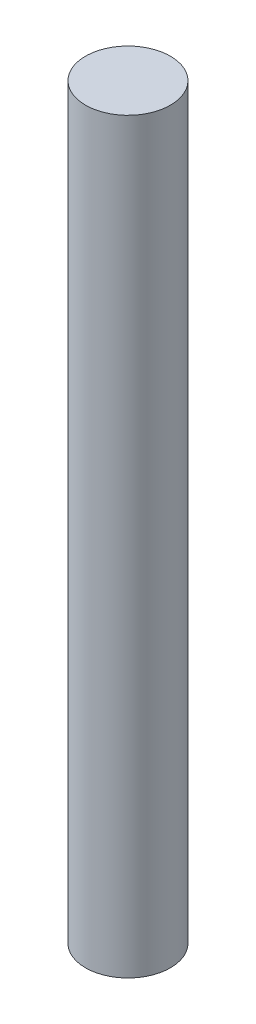
ISO-10303-21;
HEADER;
FILE_DESCRIPTION(('STEP AP214'),'2;1');
FILE_NAME('part.step','',(''),(''),'','','');
FILE_SCHEMA(('AUTOMOTIVE_DESIGN { 1 0 10303 214 1 1 1 1 }'));
ENDSEC;
DATA;
#1=APPLICATION_CONTEXT('core data for automotive mechanical design processes');
#2=APPLICATION_PROTOCOL_DEFINITION('international standard','automotive_design',2000,#1);
#3=PRODUCT_CONTEXT('',#1,'mechanical');
#4=PRODUCT('Part','Part','',(#3));
#5=PRODUCT_RELATED_PRODUCT_CATEGORY('part','',(#4));
#6=PRODUCT_DEFINITION_FORMATION('','',#4);
#7=PRODUCT_DEFINITION_CONTEXT('part definition',#1,'design');
#8=PRODUCT_DEFINITION('design','',#6,#7);
#9=PRODUCT_DEFINITION_SHAPE('','',#8);
#10=(LENGTH_UNIT() NAMED_UNIT(*) SI_UNIT(.MILLI.,.METRE.));
#11=(NAMED_UNIT(*) PLANE_ANGLE_UNIT() SI_UNIT($,.RADIAN.));
#12=(NAMED_UNIT(*) SI_UNIT($,.STERADIAN.) SOLID_ANGLE_UNIT());
#13=UNCERTAINTY_MEASURE_WITH_UNIT(LENGTH_MEASURE(1.E-05),#10,'distance_accuracy_value','');
#14=(GEOMETRIC_REPRESENTATION_CONTEXT(3) GLOBAL_UNCERTAINTY_ASSIGNED_CONTEXT((#13)) GLOBAL_UNIT_ASSIGNED_CONTEXT((#10,
#11,#12)) REPRESENTATION_CONTEXT('',''));
#15=CARTESIAN_POINT('',(0.,0.,0.));
#16=DIRECTION('',(0.,0.,1.));
#17=DIRECTION('',(1.,0.,0.));
#18=AXIS2_PLACEMENT_3D('',#15,#16,#17);
#19=CARTESIAN_POINT('',(-4.44089209850063E-13,279.4,-4.44089209850063E-13));
#20=DIRECTION('',(0.,-1.,0.));
#21=DIRECTION('',(0.,0.,-1.));
#22=AXIS2_PLACEMENT_3D('',#19,#20,#21);
#23=CYLINDRICAL_SURFACE('',#22,15.875);
#24=CARTESIAN_POINT('',(-4.44089209850063E-13,279.4,-4.44089209850063E-13));
#25=DIRECTION('',(0.,1.,0.));
#26=DIRECTION('',(0.,0.,1.));
#27=AXIS2_PLACEMENT_3D('',#24,#25,#26);
#28=CIRCLE('',#27,15.875);
#29=CARTESIAN_POINT('',(-4.44089209850063E-13,279.4,15.8749999999996));
#30=VERTEX_POINT('',#29);
#31=EDGE_CURVE('E10',#30,#30,#28,.T.);
#32=ORIENTED_EDGE('',*,*,#31,.F.);
#33=EDGE_LOOP('',(#32));
#34=FACE_BOUND('',#33,.T.);
#35=CARTESIAN_POINT('',(0.,0.,0.));
#36=DIRECTION('',(0.,1.,0.));
#37=DIRECTION('',(0.,0.,1.));
#38=AXIS2_PLACEMENT_3D('',#35,#36,#37);
#39=CIRCLE('',#38,15.875);
#40=CARTESIAN_POINT('',(0.,0.,15.875));
#41=VERTEX_POINT('',#40);
#42=EDGE_CURVE('E33',#41,#41,#39,.T.);
#43=ORIENTED_EDGE('',*,*,#42,.T.);
#44=EDGE_LOOP('',(#43));
#45=FACE_BOUND('',#44,.T.);
#46=ADVANCED_FACE('F30',(#34,#45),#23,.T.);
#47=CARTESIAN_POINT('',(-4.44089209850063E-13,279.4,-4.44089209850063E-13));
#48=DIRECTION('',(0.,1.,0.));
#49=DIRECTION('',(0.,0.,1.));
#50=AXIS2_PLACEMENT_3D('',#47,#48,#49);
#51=PLANE('',#50);
#52=ORIENTED_EDGE('',*,*,#31,.T.);
#53=EDGE_LOOP('',(#52));
#54=FACE_BOUND('',#53,.T.);
#55=ADVANCED_FACE('F45',(#54),#51,.T.);
#56=CARTESIAN_POINT('',(0.,0.,0.));
#57=DIRECTION('',(0.,1.,0.));
#58=DIRECTION('',(0.,0.,1.));
#59=AXIS2_PLACEMENT_3D('',#56,#57,#58);
#60=PLANE('',#59);
#61=ORIENTED_EDGE('',*,*,#42,.F.);
#62=EDGE_LOOP('',(#61));
#63=FACE_BOUND('',#62,.T.);
#64=ADVANCED_FACE('F43',(#63),#60,.F.);
#65=CLOSED_SHELL('',(#46,#55,#64));
#66=MANIFOLD_SOLID_BREP('B2',#65);
#67=ADVANCED_BREP_SHAPE_REPRESENTATION('',(#18,#66),#14);
#68=SHAPE_DEFINITION_REPRESENTATION(#9,#67);
ENDSEC;
END-ISO-10303-21;
